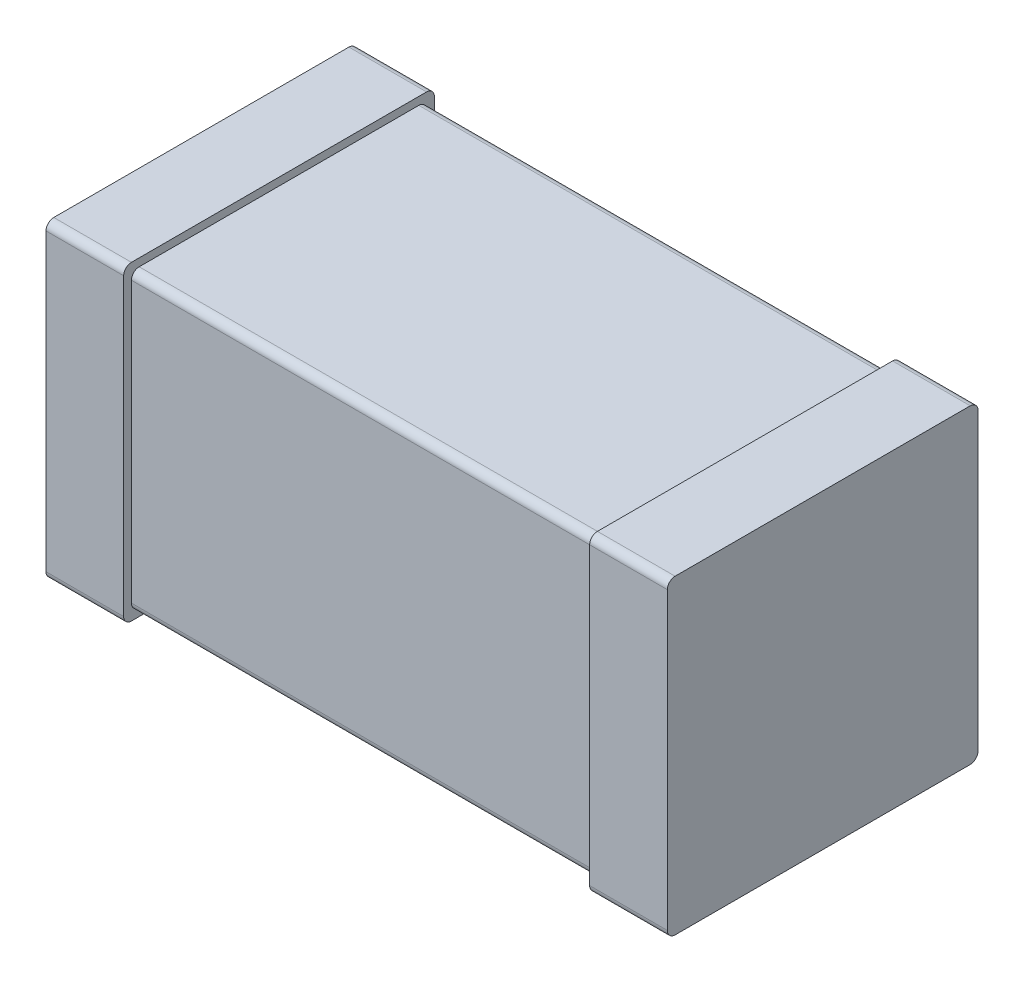
ISO-10303-21;
HEADER;
FILE_DESCRIPTION(('STEP AP214'),'2;1');
FILE_NAME('part.step','',(''),(''),'','','');
FILE_SCHEMA(('AUTOMOTIVE_DESIGN { 1 0 10303 214 1 1 1 1 }'));
ENDSEC;
DATA;
#1=APPLICATION_CONTEXT('core data for automotive mechanical design processes');
#2=APPLICATION_PROTOCOL_DEFINITION('international standard','automotive_design',2000,#1);
#3=PRODUCT_CONTEXT('',#1,'mechanical');
#4=PRODUCT('Part','Part','',(#3));
#5=PRODUCT_RELATED_PRODUCT_CATEGORY('part','',(#4));
#6=PRODUCT_DEFINITION_FORMATION('','',#4);
#7=PRODUCT_DEFINITION_CONTEXT('part definition',#1,'design');
#8=PRODUCT_DEFINITION('design','',#6,#7);
#9=PRODUCT_DEFINITION_SHAPE('','',#8);
#10=(LENGTH_UNIT() NAMED_UNIT(*) SI_UNIT(.MILLI.,.METRE.));
#11=(NAMED_UNIT(*) PLANE_ANGLE_UNIT() SI_UNIT($,.RADIAN.));
#12=(NAMED_UNIT(*) SI_UNIT($,.STERADIAN.) SOLID_ANGLE_UNIT());
#13=UNCERTAINTY_MEASURE_WITH_UNIT(LENGTH_MEASURE(1.E-05),#10,'distance_accuracy_value','');
#14=(GEOMETRIC_REPRESENTATION_CONTEXT(3) GLOBAL_UNCERTAINTY_ASSIGNED_CONTEXT((#13)) GLOBAL_UNIT_ASSIGNED_CONTEXT((#10,
#11,#12)) REPRESENTATION_CONTEXT('',''));
#15=CARTESIAN_POINT('',(0.,0.,0.));
#16=DIRECTION('',(0.,0.,1.));
#17=DIRECTION('',(1.,0.,0.));
#18=AXIS2_PLACEMENT_3D('',#15,#16,#17);
#19=CARTESIAN_POINT('',(-1.6,-0.8,0.));
#20=DIRECTION('',(1.,0.,0.));
#21=DIRECTION('',(0.,1.,0.));
#22=AXIS2_PLACEMENT_3D('',#19,#20,#21);
#23=PLANE('',#22);
#24=CARTESIAN_POINT('',(-1.6,-0.76,1.56));
#25=DIRECTION('',(-1.,0.,0.));
#26=DIRECTION('',(0.,0.,1.));
#27=AXIS2_PLACEMENT_3D('',#24,#25,#26);
#28=CIRCLE('',#27,0.04);
#29=CARTESIAN_POINT('',(-1.6,-0.8,1.56));
#30=VERTEX_POINT('',#29);
#31=CARTESIAN_POINT('',(-1.6,-0.76,1.6));
#32=VERTEX_POINT('',#31);
#33=EDGE_CURVE('E11',#30,#32,#28,.T.);
#34=ORIENTED_EDGE('',*,*,#33,.T.);
#35=DIRECTION('',(0.,1.,0.));
#36=VECTOR('',#35,1.);
#37=CARTESIAN_POINT('',(-1.6,-0.8,1.6));
#38=LINE('',#37,#36);
#39=CARTESIAN_POINT('',(-1.6,0.76,1.6));
#40=VERTEX_POINT('',#39);
#41=EDGE_CURVE('E27',#32,#40,#38,.T.);
#42=ORIENTED_EDGE('',*,*,#41,.T.);
#43=CARTESIAN_POINT('',(-1.6,0.76,1.56));
#44=DIRECTION('',(1.,0.,0.));
#45=DIRECTION('',(0.,0.,1.));
#46=AXIS2_PLACEMENT_3D('',#43,#44,#45);
#47=CIRCLE('',#46,0.04);
#48=CARTESIAN_POINT('',(-1.6,0.8,1.56));
#49=VERTEX_POINT('',#48);
#50=EDGE_CURVE('E336',#49,#40,#47,.T.);
#51=ORIENTED_EDGE('',*,*,#50,.F.);
#52=DIRECTION('',(0.,0.,1.));
#53=VECTOR('',#52,1.);
#54=CARTESIAN_POINT('',(-1.6,0.8,0.));
#55=LINE('',#54,#53);
#56=CARTESIAN_POINT('',(-1.6,0.8,0.04));
#57=VERTEX_POINT('',#56);
#58=EDGE_CURVE('E309',#57,#49,#55,.T.);
#59=ORIENTED_EDGE('',*,*,#58,.F.);
#60=CARTESIAN_POINT('',(-1.6,0.76,0.04));
#61=DIRECTION('',(-1.,0.,0.));
#62=DIRECTION('',(0.,0.,1.));
#63=AXIS2_PLACEMENT_3D('',#60,#61,#62);
#64=CIRCLE('',#63,0.04);
#65=CARTESIAN_POINT('',(-1.6,0.76,0.));
#66=VERTEX_POINT('',#65);
#67=EDGE_CURVE('E317',#57,#66,#64,.T.);
#68=ORIENTED_EDGE('',*,*,#67,.T.);
#69=DIRECTION('',(0.,1.,0.));
#70=VECTOR('',#69,1.);
#71=CARTESIAN_POINT('',(-1.6,-0.8,0.));
#72=LINE('',#71,#70);
#73=CARTESIAN_POINT('',(-1.6,-0.76,0.));
#74=VERTEX_POINT('',#73);
#75=EDGE_CURVE('E417',#74,#66,#72,.T.);
#76=ORIENTED_EDGE('',*,*,#75,.F.);
#77=CARTESIAN_POINT('',(-1.6,-0.76,0.04));
#78=DIRECTION('',(1.,0.,0.));
#79=DIRECTION('',(0.,0.,1.));
#80=AXIS2_PLACEMENT_3D('',#77,#78,#79);
#81=CIRCLE('',#80,0.04);
#82=CARTESIAN_POINT('',(-1.6,-0.8,0.04));
#83=VERTEX_POINT('',#82);
#84=EDGE_CURVE('E397',#83,#74,#81,.T.);
#85=ORIENTED_EDGE('',*,*,#84,.F.);
#86=DIRECTION('',(0.,0.,1.));
#87=VECTOR('',#86,1.);
#88=CARTESIAN_POINT('',(-1.6,-0.8,0.));
#89=LINE('',#88,#87);
#90=EDGE_CURVE('E364',#83,#30,#89,.T.);
#91=ORIENTED_EDGE('',*,*,#90,.T.);
#92=EDGE_LOOP('',(#34,#42,#51,#59,#68,#76,#85,#91));
#93=FACE_BOUND('',#92,.T.);
#94=ADVANCED_FACE('F16',(#93),#23,.F.);
#95=CARTESIAN_POINT('',(-1.6,-0.8,0.));
#96=DIRECTION('',(0.,1.,0.));
#97=DIRECTION('',(1.,0.,0.));
#98=AXIS2_PLACEMENT_3D('',#95,#96,#97);
#99=PLANE('',#98);
#100=DIRECTION('',(1.,0.,0.));
#101=VECTOR('',#100,1.);
#102=CARTESIAN_POINT('',(-1.6,-0.8,1.56));
#103=LINE('',#102,#101);
#104=CARTESIAN_POINT('',(-1.2,-0.8,1.56));
#105=VERTEX_POINT('',#104);
#106=EDGE_CURVE('E322',#30,#105,#103,.T.);
#107=ORIENTED_EDGE('',*,*,#106,.F.);
#108=ORIENTED_EDGE('',*,*,#90,.F.);
#109=DIRECTION('',(1.,0.,0.));
#110=VECTOR('',#109,1.);
#111=CARTESIAN_POINT('',(-1.6,-0.8,0.04));
#112=LINE('',#111,#110);
#113=CARTESIAN_POINT('',(-1.2,-0.8,0.04));
#114=VERTEX_POINT('',#113);
#115=EDGE_CURVE('E383',#83,#114,#112,.T.);
#116=ORIENTED_EDGE('',*,*,#115,.T.);
#117=DIRECTION('',(0.,0.,1.));
#118=VECTOR('',#117,1.);
#119=CARTESIAN_POINT('',(-1.2,-0.8,0.));
#120=LINE('',#119,#118);
#121=EDGE_CURVE('E386',#114,#105,#120,.T.);
#122=ORIENTED_EDGE('',*,*,#121,.T.);
#123=EDGE_LOOP('',(#107,#108,#116,#122));
#124=FACE_BOUND('',#123,.T.);
#125=ADVANCED_FACE('F614',(#124),#99,.F.);
#126=CARTESIAN_POINT('',(-1.6,-0.76,0.04));
#127=DIRECTION('',(1.,0.,0.));
#128=DIRECTION('',(0.,-1.,0.));
#129=AXIS2_PLACEMENT_3D('',#126,#127,#128);
#130=CYLINDRICAL_SURFACE('',#129,0.04);
#131=ORIENTED_EDGE('',*,*,#84,.T.);
#132=DIRECTION('',(1.,0.,0.));
#133=VECTOR('',#132,1.);
#134=CARTESIAN_POINT('',(-1.6,-0.76,0.));
#135=LINE('',#134,#133);
#136=CARTESIAN_POINT('',(-1.2,-0.76,0.));
#137=VERTEX_POINT('',#136);
#138=EDGE_CURVE('E324',#74,#137,#135,.T.);
#139=ORIENTED_EDGE('',*,*,#138,.T.);
#140=CARTESIAN_POINT('',(-1.2,-0.76,0.04));
#141=DIRECTION('',(1.,0.,0.));
#142=DIRECTION('',(0.,0.,1.));
#143=AXIS2_PLACEMENT_3D('',#140,#141,#142);
#144=CIRCLE('',#143,0.04);
#145=EDGE_CURVE('E310',#114,#137,#144,.T.);
#146=ORIENTED_EDGE('',*,*,#145,.F.);
#147=ORIENTED_EDGE('',*,*,#115,.F.);
#148=EDGE_LOOP('',(#131,#139,#146,#147));
#149=FACE_BOUND('',#148,.T.);
#150=ADVANCED_FACE('F618',(#149),#130,.T.);
#151=CARTESIAN_POINT('',(-1.6,-0.76,1.56));
#152=DIRECTION('',(1.,0.,0.));
#153=DIRECTION('',(0.,-1.,0.));
#154=AXIS2_PLACEMENT_3D('',#151,#152,#153);
#155=CYLINDRICAL_SURFACE('',#154,0.04);
#156=ORIENTED_EDGE('',*,*,#106,.T.);
#157=CARTESIAN_POINT('',(-1.2,-0.76,1.56));
#158=DIRECTION('',(-1.,0.,0.));
#159=DIRECTION('',(0.,0.,1.));
#160=AXIS2_PLACEMENT_3D('',#157,#158,#159);
#161=CIRCLE('',#160,0.04);
#162=CARTESIAN_POINT('',(-1.2,-0.76,1.6));
#163=VERTEX_POINT('',#162);
#164=EDGE_CURVE('E325',#105,#163,#161,.T.);
#165=ORIENTED_EDGE('',*,*,#164,.T.);
#166=DIRECTION('',(1.,0.,0.));
#167=VECTOR('',#166,1.);
#168=CARTESIAN_POINT('',(-1.6,-0.76,1.6));
#169=LINE('',#168,#167);
#170=EDGE_CURVE('E468',#32,#163,#169,.T.);
#171=ORIENTED_EDGE('',*,*,#170,.F.);
#172=ORIENTED_EDGE('',*,*,#33,.F.);
#173=EDGE_LOOP('',(#156,#165,#171,#172));
#174=FACE_BOUND('',#173,.T.);
#175=ADVANCED_FACE('F682',(#174),#155,.T.);
#176=CARTESIAN_POINT('',(-1.6,-0.8,0.));
#177=DIRECTION('',(0.,0.,1.));
#178=DIRECTION('',(1.,0.,0.));
#179=AXIS2_PLACEMENT_3D('',#176,#177,#178);
#180=PLANE('',#179);
#181=DIRECTION('',(1.,0.,0.));
#182=VECTOR('',#181,1.);
#183=CARTESIAN_POINT('',(-1.6,0.76,0.));
#184=LINE('',#183,#182);
#185=CARTESIAN_POINT('',(-1.2,0.76,0.));
#186=VERTEX_POINT('',#185);
#187=EDGE_CURVE('E413',#66,#186,#184,.T.);
#188=ORIENTED_EDGE('',*,*,#187,.T.);
#189=DIRECTION('',(0.,1.,0.));
#190=VECTOR('',#189,1.);
#191=CARTESIAN_POINT('',(-1.2,-0.8,0.));
#192=LINE('',#191,#190);
#193=EDGE_CURVE('E430',#137,#186,#192,.T.);
#194=ORIENTED_EDGE('',*,*,#193,.F.);
#195=ORIENTED_EDGE('',*,*,#138,.F.);
#196=ORIENTED_EDGE('',*,*,#75,.T.);
#197=EDGE_LOOP('',(#188,#194,#195,#196));
#198=FACE_BOUND('',#197,.T.);
#199=ADVANCED_FACE('F563',(#198),#180,.F.);
#200=CARTESIAN_POINT('',(-1.6,-0.8,1.6));
#201=DIRECTION('',(0.,0.,1.));
#202=DIRECTION('',(1.,0.,0.));
#203=AXIS2_PLACEMENT_3D('',#200,#201,#202);
#204=PLANE('',#203);
#205=ORIENTED_EDGE('',*,*,#41,.F.);
#206=ORIENTED_EDGE('',*,*,#170,.T.);
#207=DIRECTION('',(0.,1.,0.));
#208=VECTOR('',#207,1.);
#209=CARTESIAN_POINT('',(-1.2,-0.8,1.6));
#210=LINE('',#209,#208);
#211=CARTESIAN_POINT('',(-1.2,0.76,1.6));
#212=VERTEX_POINT('',#211);
#213=EDGE_CURVE('E471',#163,#212,#210,.T.);
#214=ORIENTED_EDGE('',*,*,#213,.T.);
#215=DIRECTION('',(1.,0.,0.));
#216=VECTOR('',#215,1.);
#217=CARTESIAN_POINT('',(-1.6,0.76,1.6));
#218=LINE('',#217,#216);
#219=EDGE_CURVE('E328',#40,#212,#218,.T.);
#220=ORIENTED_EDGE('',*,*,#219,.F.);
#221=EDGE_LOOP('',(#205,#206,#214,#220));
#222=FACE_BOUND('',#221,.T.);
#223=ADVANCED_FACE('F742',(#222),#204,.T.);
#224=CARTESIAN_POINT('',(-1.6,0.76,0.04));
#225=DIRECTION('',(1.,0.,0.));
#226=DIRECTION('',(0.,1.,0.));
#227=AXIS2_PLACEMENT_3D('',#224,#225,#226);
#228=CYLINDRICAL_SURFACE('',#227,0.04);
#229=DIRECTION('',(1.,0.,0.));
#230=VECTOR('',#229,1.);
#231=CARTESIAN_POINT('',(-1.6,0.8,0.04));
#232=LINE('',#231,#230);
#233=CARTESIAN_POINT('',(-1.2,0.8,0.04));
#234=VERTEX_POINT('',#233);
#235=EDGE_CURVE('E478',#57,#234,#232,.T.);
#236=ORIENTED_EDGE('',*,*,#235,.T.);
#237=CARTESIAN_POINT('',(-1.2,0.76,0.04));
#238=DIRECTION('',(-1.,0.,0.));
#239=DIRECTION('',(0.,0.,1.));
#240=AXIS2_PLACEMENT_3D('',#237,#238,#239);
#241=CIRCLE('',#240,0.04);
#242=EDGE_CURVE('E343',#234,#186,#241,.T.);
#243=ORIENTED_EDGE('',*,*,#242,.T.);
#244=ORIENTED_EDGE('',*,*,#187,.F.);
#245=ORIENTED_EDGE('',*,*,#67,.F.);
#246=EDGE_LOOP('',(#236,#243,#244,#245));
#247=FACE_BOUND('',#246,.T.);
#248=ADVANCED_FACE('F554',(#247),#228,.T.);
#249=CARTESIAN_POINT('',(-1.6,0.76,1.56));
#250=DIRECTION('',(1.,0.,0.));
#251=DIRECTION('',(0.,1.,0.));
#252=AXIS2_PLACEMENT_3D('',#249,#250,#251);
#253=CYLINDRICAL_SURFACE('',#252,0.04);
#254=ORIENTED_EDGE('',*,*,#50,.T.);
#255=ORIENTED_EDGE('',*,*,#219,.T.);
#256=CARTESIAN_POINT('',(-1.2,0.76,1.56));
#257=DIRECTION('',(1.,0.,0.));
#258=DIRECTION('',(0.,0.,1.));
#259=AXIS2_PLACEMENT_3D('',#256,#257,#258);
#260=CIRCLE('',#259,0.04);
#261=CARTESIAN_POINT('',(-1.2,0.8,1.56));
#262=VERTEX_POINT('',#261);
#263=EDGE_CURVE('E91',#262,#212,#260,.T.);
#264=ORIENTED_EDGE('',*,*,#263,.F.);
#265=DIRECTION('',(1.,0.,0.));
#266=VECTOR('',#265,1.);
#267=CARTESIAN_POINT('',(-1.6,0.8,1.56));
#268=LINE('',#267,#266);
#269=EDGE_CURVE('E306',#49,#262,#268,.T.);
#270=ORIENTED_EDGE('',*,*,#269,.F.);
#271=EDGE_LOOP('',(#254,#255,#264,#270));
#272=FACE_BOUND('',#271,.T.);
#273=ADVANCED_FACE('F673',(#272),#253,.T.);
#274=CARTESIAN_POINT('',(-1.6,0.8,0.));
#275=DIRECTION('',(0.,1.,0.));
#276=DIRECTION('',(1.,0.,0.));
#277=AXIS2_PLACEMENT_3D('',#274,#275,#276);
#278=PLANE('',#277);
#279=DIRECTION('',(0.,0.,1.));
#280=VECTOR('',#279,1.);
#281=CARTESIAN_POINT('',(-1.2,0.8,0.));
#282=LINE('',#281,#280);
#283=EDGE_CURVE('E420',#234,#262,#282,.T.);
#284=ORIENTED_EDGE('',*,*,#283,.F.);
#285=ORIENTED_EDGE('',*,*,#235,.F.);
#286=ORIENTED_EDGE('',*,*,#58,.T.);
#287=ORIENTED_EDGE('',*,*,#269,.T.);
#288=EDGE_LOOP('',(#284,#285,#286,#287));
#289=FACE_BOUND('',#288,.T.);
#290=ADVANCED_FACE('F556',(#289),#278,.T.);
#291=CARTESIAN_POINT('',(-1.2,-0.8,0.));
#292=DIRECTION('',(1.,0.,0.));
#293=DIRECTION('',(0.,1.,0.));
#294=AXIS2_PLACEMENT_3D('',#291,#292,#293);
#295=PLANE('',#294);
#296=ORIENTED_EDGE('',*,*,#121,.F.);
#297=ORIENTED_EDGE('',*,*,#145,.T.);
#298=ORIENTED_EDGE('',*,*,#193,.T.);
#299=ORIENTED_EDGE('',*,*,#242,.F.);
#300=ORIENTED_EDGE('',*,*,#283,.T.);
#301=ORIENTED_EDGE('',*,*,#263,.T.);
#302=ORIENTED_EDGE('',*,*,#213,.F.);
#303=ORIENTED_EDGE('',*,*,#164,.F.);
#304=EDGE_LOOP('',(#296,#297,#298,#299,#300,#301,#302,#303));
#305=FACE_BOUND('',#304,.T.);
#306=CARTESIAN_POINT('',(-1.2,-0.72,0.08));
#307=DIRECTION('',(1.,0.,0.));
#308=DIRECTION('',(0.,0.,1.));
#309=AXIS2_PLACEMENT_3D('',#306,#307,#308);
#310=CIRCLE('',#309,0.04);
#311=CARTESIAN_POINT('',(-1.2,-0.76,0.08));
#312=VERTEX_POINT('',#311);
#313=CARTESIAN_POINT('',(-1.2,-0.72,0.04));
#314=VERTEX_POINT('',#313);
#315=EDGE_CURVE('E108',#312,#314,#310,.T.);
#316=ORIENTED_EDGE('',*,*,#315,.F.);
#317=DIRECTION('',(0.,0.,1.));
#318=VECTOR('',#317,1.);
#319=CARTESIAN_POINT('',(-1.2,-0.76,0.04));
#320=LINE('',#319,#318);
#321=CARTESIAN_POINT('',(-1.2,-0.76,1.52));
#322=VERTEX_POINT('',#321);
#323=EDGE_CURVE('E421',#312,#322,#320,.T.);
#324=ORIENTED_EDGE('',*,*,#323,.T.);
#325=CARTESIAN_POINT('',(-1.2,-0.72,1.52));
#326=DIRECTION('',(-1.,0.,0.));
#327=DIRECTION('',(0.,0.,1.));
#328=AXIS2_PLACEMENT_3D('',#325,#326,#327);
#329=CIRCLE('',#328,0.04);
#330=CARTESIAN_POINT('',(-1.2,-0.72,1.56));
#331=VERTEX_POINT('',#330);
#332=EDGE_CURVE('E352',#322,#331,#329,.T.);
#333=ORIENTED_EDGE('',*,*,#332,.T.);
#334=DIRECTION('',(0.,1.,0.));
#335=VECTOR('',#334,1.);
#336=CARTESIAN_POINT('',(-1.2,-0.76,1.56));
#337=LINE('',#336,#335);
#338=CARTESIAN_POINT('',(-1.2,0.72,1.56));
#339=VERTEX_POINT('',#338);
#340=EDGE_CURVE('E348',#331,#339,#337,.T.);
#341=ORIENTED_EDGE('',*,*,#340,.T.);
#342=CARTESIAN_POINT('',(-1.2,0.72,1.52));
#343=DIRECTION('',(1.,0.,0.));
#344=DIRECTION('',(0.,0.,1.));
#345=AXIS2_PLACEMENT_3D('',#342,#343,#344);
#346=CIRCLE('',#345,0.04);
#347=CARTESIAN_POINT('',(-1.2,0.76,1.52));
#348=VERTEX_POINT('',#347);
#349=EDGE_CURVE('E354',#348,#339,#346,.T.);
#350=ORIENTED_EDGE('',*,*,#349,.F.);
#351=DIRECTION('',(0.,0.,1.));
#352=VECTOR('',#351,1.);
#353=CARTESIAN_POINT('',(-1.2,0.76,0.04));
#354=LINE('',#353,#352);
#355=CARTESIAN_POINT('',(-1.2,0.76,0.08));
#356=VERTEX_POINT('',#355);
#357=EDGE_CURVE('E475',#356,#348,#354,.T.);
#358=ORIENTED_EDGE('',*,*,#357,.F.);
#359=CARTESIAN_POINT('',(-1.2,0.72,0.08));
#360=DIRECTION('',(-1.,0.,0.));
#361=DIRECTION('',(0.,0.,1.));
#362=AXIS2_PLACEMENT_3D('',#359,#360,#361);
#363=CIRCLE('',#362,0.04);
#364=CARTESIAN_POINT('',(-1.2,0.72,0.04));
#365=VERTEX_POINT('',#364);
#366=EDGE_CURVE('E353',#356,#365,#363,.T.);
#367=ORIENTED_EDGE('',*,*,#366,.T.);
#368=DIRECTION('',(0.,1.,0.));
#369=VECTOR('',#368,1.);
#370=CARTESIAN_POINT('',(-1.2,-0.76,0.04));
#371=LINE('',#370,#369);
#372=EDGE_CURVE('E411',#314,#365,#371,.T.);
#373=ORIENTED_EDGE('',*,*,#372,.F.);
#374=EDGE_LOOP('',(#316,#324,#333,#341,#350,#358,#367,#373));
#375=FACE_BOUND('',#374,.T.);
#376=ADVANCED_FACE('F453',(#305,#375),#295,.T.);
#377=CARTESIAN_POINT('',(-1.2,-0.72,0.08));
#378=DIRECTION('',(1.,0.,0.));
#379=DIRECTION('',(0.,-1.,0.));
#380=AXIS2_PLACEMENT_3D('',#377,#378,#379);
#381=CYLINDRICAL_SURFACE('',#380,0.04);
#382=ORIENTED_EDGE('',*,*,#315,.T.);
#383=DIRECTION('',(1.,0.,0.));
#384=VECTOR('',#383,1.);
#385=CARTESIAN_POINT('',(-1.2,-0.72,0.04));
#386=LINE('',#385,#384);
#387=CARTESIAN_POINT('',(1.2,-0.72,0.04));
#388=VERTEX_POINT('',#387);
#389=EDGE_CURVE('E261',#314,#388,#386,.T.);
#390=ORIENTED_EDGE('',*,*,#389,.T.);
#391=CARTESIAN_POINT('',(1.2,-0.72,0.08));
#392=DIRECTION('',(1.,0.,0.));
#393=DIRECTION('',(0.,0.,1.));
#394=AXIS2_PLACEMENT_3D('',#391,#392,#393);
#395=CIRCLE('',#394,0.04);
#396=CARTESIAN_POINT('',(1.2,-0.76,0.08));
#397=VERTEX_POINT('',#396);
#398=EDGE_CURVE('E243',#397,#388,#395,.T.);
#399=ORIENTED_EDGE('',*,*,#398,.F.);
#400=DIRECTION('',(1.,0.,0.));
#401=VECTOR('',#400,1.);
#402=CARTESIAN_POINT('',(-1.2,-0.76,0.08));
#403=LINE('',#402,#401);
#404=EDGE_CURVE('E378',#312,#397,#403,.T.);
#405=ORIENTED_EDGE('',*,*,#404,.F.);
#406=EDGE_LOOP('',(#382,#390,#399,#405));
#407=FACE_BOUND('',#406,.T.);
#408=ADVANCED_FACE('F262',(#407),#381,.T.);
#409=CARTESIAN_POINT('',(-1.2,-0.76,0.04));
#410=DIRECTION('',(0.,0.,1.));
#411=DIRECTION('',(1.,0.,0.));
#412=AXIS2_PLACEMENT_3D('',#409,#410,#411);
#413=PLANE('',#412);
#414=DIRECTION('',(1.,0.,0.));
#415=VECTOR('',#414,1.);
#416=CARTESIAN_POINT('',(-1.2,0.72,0.04));
#417=LINE('',#416,#415);
#418=CARTESIAN_POINT('',(1.2,0.72,0.04));
#419=VERTEX_POINT('',#418);
#420=EDGE_CURVE('E265',#365,#419,#417,.T.);
#421=ORIENTED_EDGE('',*,*,#420,.T.);
#422=DIRECTION('',(0.,1.,0.));
#423=VECTOR('',#422,1.);
#424=CARTESIAN_POINT('',(1.2,-0.76,0.04));
#425=LINE('',#424,#423);
#426=EDGE_CURVE('E248',#388,#419,#425,.T.);
#427=ORIENTED_EDGE('',*,*,#426,.F.);
#428=ORIENTED_EDGE('',*,*,#389,.F.);
#429=ORIENTED_EDGE('',*,*,#372,.T.);
#430=EDGE_LOOP('',(#421,#427,#428,#429));
#431=FACE_BOUND('',#430,.T.);
#432=ADVANCED_FACE('F267',(#431),#413,.F.);
#433=CARTESIAN_POINT('',(-1.2,0.72,0.08));
#434=DIRECTION('',(1.,0.,0.));
#435=DIRECTION('',(0.,1.,0.));
#436=AXIS2_PLACEMENT_3D('',#433,#434,#435);
#437=CYLINDRICAL_SURFACE('',#436,0.04);
#438=DIRECTION('',(1.,0.,0.));
#439=VECTOR('',#438,1.);
#440=CARTESIAN_POINT('',(-1.2,0.76,0.08));
#441=LINE('',#440,#439);
#442=CARTESIAN_POINT('',(1.2,0.76,0.08));
#443=VERTEX_POINT('',#442);
#444=EDGE_CURVE('E20',#356,#443,#441,.T.);
#445=ORIENTED_EDGE('',*,*,#444,.T.);
#446=CARTESIAN_POINT('',(1.2,0.72,0.08));
#447=DIRECTION('',(-1.,0.,0.));
#448=DIRECTION('',(0.,0.,1.));
#449=AXIS2_PLACEMENT_3D('',#446,#447,#448);
#450=CIRCLE('',#449,0.04);
#451=EDGE_CURVE('E472',#443,#419,#450,.T.);
#452=ORIENTED_EDGE('',*,*,#451,.T.);
#453=ORIENTED_EDGE('',*,*,#420,.F.);
#454=ORIENTED_EDGE('',*,*,#366,.F.);
#455=EDGE_LOOP('',(#445,#452,#453,#454));
#456=FACE_BOUND('',#455,.T.);
#457=ADVANCED_FACE('F692',(#456),#437,.T.);
#458=CARTESIAN_POINT('',(-1.2,0.76,0.04));
#459=DIRECTION('',(0.,1.,0.));
#460=DIRECTION('',(1.,0.,0.));
#461=AXIS2_PLACEMENT_3D('',#458,#459,#460);
#462=PLANE('',#461);
#463=DIRECTION('',(0.,0.,1.));
#464=VECTOR('',#463,1.);
#465=CARTESIAN_POINT('',(1.2,0.76,0.04));
#466=LINE('',#465,#464);
#467=CARTESIAN_POINT('',(1.2,0.76,1.52));
#468=VERTEX_POINT('',#467);
#469=EDGE_CURVE('E272',#443,#468,#466,.T.);
#470=ORIENTED_EDGE('',*,*,#469,.F.);
#471=ORIENTED_EDGE('',*,*,#444,.F.);
#472=ORIENTED_EDGE('',*,*,#357,.T.);
#473=DIRECTION('',(1.,0.,0.));
#474=VECTOR('',#473,1.);
#475=CARTESIAN_POINT('',(-1.2,0.76,1.52));
#476=LINE('',#475,#474);
#477=EDGE_CURVE('E357',#348,#468,#476,.T.);
#478=ORIENTED_EDGE('',*,*,#477,.T.);
#479=EDGE_LOOP('',(#470,#471,#472,#478));
#480=FACE_BOUND('',#479,.T.);
#481=ADVANCED_FACE('F636',(#480),#462,.T.);
#482=CARTESIAN_POINT('',(-1.2,0.72,1.52));
#483=DIRECTION('',(1.,0.,0.));
#484=DIRECTION('',(0.,1.,0.));
#485=AXIS2_PLACEMENT_3D('',#482,#483,#484);
#486=CYLINDRICAL_SURFACE('',#485,0.04);
#487=ORIENTED_EDGE('',*,*,#349,.T.);
#488=DIRECTION('',(1.,0.,0.));
#489=VECTOR('',#488,1.);
#490=CARTESIAN_POINT('',(-1.2,0.72,1.56));
#491=LINE('',#490,#489);
#492=CARTESIAN_POINT('',(1.2,0.72,1.56));
#493=VERTEX_POINT('',#492);
#494=EDGE_CURVE('E358',#339,#493,#491,.T.);
#495=ORIENTED_EDGE('',*,*,#494,.T.);
#496=CARTESIAN_POINT('',(1.2,0.72,1.52));
#497=DIRECTION('',(1.,0.,0.));
#498=DIRECTION('',(0.,0.,1.));
#499=AXIS2_PLACEMENT_3D('',#496,#497,#498);
#500=CIRCLE('',#499,0.04);
#501=EDGE_CURVE('E257',#468,#493,#500,.T.);
#502=ORIENTED_EDGE('',*,*,#501,.F.);
#503=ORIENTED_EDGE('',*,*,#477,.F.);
#504=EDGE_LOOP('',(#487,#495,#502,#503));
#505=FACE_BOUND('',#504,.T.);
#506=ADVANCED_FACE('F632',(#505),#486,.T.);
#507=CARTESIAN_POINT('',(-1.2,-0.76,1.56));
#508=DIRECTION('',(0.,0.,1.));
#509=DIRECTION('',(1.,0.,0.));
#510=AXIS2_PLACEMENT_3D('',#507,#508,#509);
#511=PLANE('',#510);
#512=ORIENTED_EDGE('',*,*,#340,.F.);
#513=DIRECTION('',(1.,0.,0.));
#514=VECTOR('',#513,1.);
#515=CARTESIAN_POINT('',(-1.2,-0.72,1.56));
#516=LINE('',#515,#514);
#517=CARTESIAN_POINT('',(1.2,-0.72,1.56));
#518=VERTEX_POINT('',#517);
#519=EDGE_CURVE('E284',#331,#518,#516,.T.);
#520=ORIENTED_EDGE('',*,*,#519,.T.);
#521=DIRECTION('',(0.,1.,0.));
#522=VECTOR('',#521,1.);
#523=CARTESIAN_POINT('',(1.2,-0.76,1.56));
#524=LINE('',#523,#522);
#525=EDGE_CURVE('E376',#518,#493,#524,.T.);
#526=ORIENTED_EDGE('',*,*,#525,.T.);
#527=ORIENTED_EDGE('',*,*,#494,.F.);
#528=EDGE_LOOP('',(#512,#520,#526,#527));
#529=FACE_BOUND('',#528,.T.);
#530=ADVANCED_FACE('F451',(#529),#511,.T.);
#531=CARTESIAN_POINT('',(-1.2,-0.72,1.52));
#532=DIRECTION('',(1.,0.,0.));
#533=DIRECTION('',(0.,-1.,0.));
#534=AXIS2_PLACEMENT_3D('',#531,#532,#533);
#535=CYLINDRICAL_SURFACE('',#534,0.04);
#536=DIRECTION('',(1.,0.,0.));
#537=VECTOR('',#536,1.);
#538=CARTESIAN_POINT('',(-1.2,-0.76,1.52));
#539=LINE('',#538,#537);
#540=CARTESIAN_POINT('',(1.2,-0.76,1.52));
#541=VERTEX_POINT('',#540);
#542=EDGE_CURVE('E372',#322,#541,#539,.T.);
#543=ORIENTED_EDGE('',*,*,#542,.T.);
#544=CARTESIAN_POINT('',(1.2,-0.72,1.52));
#545=DIRECTION('',(-1.,0.,0.));
#546=DIRECTION('',(0.,0.,1.));
#547=AXIS2_PLACEMENT_3D('',#544,#545,#546);
#548=CIRCLE('',#547,0.04);
#549=EDGE_CURVE('E377',#541,#518,#548,.T.);
#550=ORIENTED_EDGE('',*,*,#549,.T.);
#551=ORIENTED_EDGE('',*,*,#519,.F.);
#552=ORIENTED_EDGE('',*,*,#332,.F.);
#553=EDGE_LOOP('',(#543,#550,#551,#552));
#554=FACE_BOUND('',#553,.T.);
#555=ADVANCED_FACE('F442',(#554),#535,.T.);
#556=CARTESIAN_POINT('',(-1.2,-0.76,0.04));
#557=DIRECTION('',(0.,1.,0.));
#558=DIRECTION('',(1.,0.,0.));
#559=AXIS2_PLACEMENT_3D('',#556,#557,#558);
#560=PLANE('',#559);
#561=ORIENTED_EDGE('',*,*,#542,.F.);
#562=ORIENTED_EDGE('',*,*,#323,.F.);
#563=ORIENTED_EDGE('',*,*,#404,.T.);
#564=DIRECTION('',(0.,0.,1.));
#565=VECTOR('',#564,1.);
#566=CARTESIAN_POINT('',(1.2,-0.76,0.04));
#567=LINE('',#566,#565);
#568=EDGE_CURVE('E252',#397,#541,#567,.T.);
#569=ORIENTED_EDGE('',*,*,#568,.T.);
#570=EDGE_LOOP('',(#561,#562,#563,#569));
#571=FACE_BOUND('',#570,.T.);
#572=ADVANCED_FACE('F18',(#571),#560,.F.);
#573=CARTESIAN_POINT('',(1.2,-0.8,0.));
#574=DIRECTION('',(1.,0.,0.));
#575=DIRECTION('',(0.,1.,0.));
#576=AXIS2_PLACEMENT_3D('',#573,#574,#575);
#577=PLANE('',#576);
#578=CARTESIAN_POINT('',(1.2,-0.76,1.56));
#579=DIRECTION('',(-1.,0.,0.));
#580=DIRECTION('',(0.,0.,1.));
#581=AXIS2_PLACEMENT_3D('',#578,#579,#580);
#582=CIRCLE('',#581,0.04);
#583=CARTESIAN_POINT('',(1.2,-0.8,1.56));
#584=VERTEX_POINT('',#583);
#585=CARTESIAN_POINT('',(1.2,-0.76,1.6));
#586=VERTEX_POINT('',#585);
#587=EDGE_CURVE('E301',#584,#586,#582,.T.);
#588=ORIENTED_EDGE('',*,*,#587,.T.);
#589=DIRECTION('',(0.,1.,0.));
#590=VECTOR('',#589,1.);
#591=CARTESIAN_POINT('',(1.2,-0.8,1.6));
#592=LINE('',#591,#590);
#593=CARTESIAN_POINT('',(1.2,0.76,1.6));
#594=VERTEX_POINT('',#593);
#595=EDGE_CURVE('E305',#586,#594,#592,.T.);
#596=ORIENTED_EDGE('',*,*,#595,.T.);
#597=CARTESIAN_POINT('',(1.2,0.76,1.56));
#598=DIRECTION('',(1.,0.,0.));
#599=DIRECTION('',(0.,0.,1.));
#600=AXIS2_PLACEMENT_3D('',#597,#598,#599);
#601=CIRCLE('',#600,0.04);
#602=CARTESIAN_POINT('',(1.2,0.8,1.56));
#603=VERTEX_POINT('',#602);
#604=EDGE_CURVE('E424',#603,#594,#601,.T.);
#605=ORIENTED_EDGE('',*,*,#604,.F.);
#606=DIRECTION('',(0.,0.,1.));
#607=VECTOR('',#606,1.);
#608=CARTESIAN_POINT('',(1.2,0.8,0.));
#609=LINE('',#608,#607);
#610=CARTESIAN_POINT('',(1.2,0.8,0.04));
#611=VERTEX_POINT('',#610);
#612=EDGE_CURVE('E178',#611,#603,#609,.T.);
#613=ORIENTED_EDGE('',*,*,#612,.F.);
#614=CARTESIAN_POINT('',(1.2,0.76,0.04));
#615=DIRECTION('',(-1.,0.,0.));
#616=DIRECTION('',(0.,0.,1.));
#617=AXIS2_PLACEMENT_3D('',#614,#615,#616);
#618=CIRCLE('',#617,0.04);
#619=CARTESIAN_POINT('',(1.2,0.76,0.));
#620=VERTEX_POINT('',#619);
#621=EDGE_CURVE('E278',#611,#620,#618,.T.);
#622=ORIENTED_EDGE('',*,*,#621,.T.);
#623=DIRECTION('',(0.,1.,0.));
#624=VECTOR('',#623,1.);
#625=CARTESIAN_POINT('',(1.2,-0.8,0.));
#626=LINE('',#625,#624);
#627=CARTESIAN_POINT('',(1.2,-0.76,0.));
#628=VERTEX_POINT('',#627);
#629=EDGE_CURVE('E365',#628,#620,#626,.T.);
#630=ORIENTED_EDGE('',*,*,#629,.F.);
#631=CARTESIAN_POINT('',(1.2,-0.76,0.04));
#632=DIRECTION('',(1.,0.,0.));
#633=DIRECTION('',(0.,0.,1.));
#634=AXIS2_PLACEMENT_3D('',#631,#632,#633);
#635=CIRCLE('',#634,0.04);
#636=CARTESIAN_POINT('',(1.2,-0.8,0.04));
#637=VERTEX_POINT('',#636);
#638=EDGE_CURVE('E463',#637,#628,#635,.T.);
#639=ORIENTED_EDGE('',*,*,#638,.F.);
#640=DIRECTION('',(0.,0.,1.));
#641=VECTOR('',#640,1.);
#642=CARTESIAN_POINT('',(1.2,-0.8,0.));
#643=LINE('',#642,#641);
#644=EDGE_CURVE('E271',#637,#584,#643,.T.);
#645=ORIENTED_EDGE('',*,*,#644,.T.);
#646=EDGE_LOOP('',(#588,#596,#605,#613,#622,#630,#639,#645));
#647=FACE_BOUND('',#646,.T.);
#648=ORIENTED_EDGE('',*,*,#426,.T.);
#649=ORIENTED_EDGE('',*,*,#451,.F.);
#650=ORIENTED_EDGE('',*,*,#469,.T.);
#651=ORIENTED_EDGE('',*,*,#501,.T.);
#652=ORIENTED_EDGE('',*,*,#525,.F.);
#653=ORIENTED_EDGE('',*,*,#549,.F.);
#654=ORIENTED_EDGE('',*,*,#568,.F.);
#655=ORIENTED_EDGE('',*,*,#398,.T.);
#656=EDGE_LOOP('',(#648,#649,#650,#651,#652,#653,#654,#655));
#657=FACE_BOUND('',#656,.T.);
#658=ADVANCED_FACE('F245',(#647,#657),#577,.F.);
#659=CARTESIAN_POINT('',(1.2,-0.8,0.));
#660=DIRECTION('',(0.,1.,0.));
#661=DIRECTION('',(1.,0.,0.));
#662=AXIS2_PLACEMENT_3D('',#659,#660,#661);
#663=PLANE('',#662);
#664=DIRECTION('',(1.,0.,0.));
#665=VECTOR('',#664,1.);
#666=CARTESIAN_POINT('',(1.2,-0.8,1.56));
#667=LINE('',#666,#665);
#668=CARTESIAN_POINT('',(1.6,-0.8,1.56));
#669=VERTEX_POINT('',#668);
#670=EDGE_CURVE('E286',#584,#669,#667,.T.);
#671=ORIENTED_EDGE('',*,*,#670,.F.);
#672=ORIENTED_EDGE('',*,*,#644,.F.);
#673=DIRECTION('',(1.,0.,0.));
#674=VECTOR('',#673,1.);
#675=CARTESIAN_POINT('',(1.2,-0.8,0.04));
#676=LINE('',#675,#674);
#677=CARTESIAN_POINT('',(1.6,-0.8,0.04));
#678=VERTEX_POINT('',#677);
#679=EDGE_CURVE('E258',#637,#678,#676,.T.);
#680=ORIENTED_EDGE('',*,*,#679,.T.);
#681=DIRECTION('',(0.,0.,1.));
#682=VECTOR('',#681,1.);
#683=CARTESIAN_POINT('',(1.6,-0.8,0.));
#684=LINE('',#683,#682);
#685=EDGE_CURVE('E409',#678,#669,#684,.T.);
#686=ORIENTED_EDGE('',*,*,#685,.T.);
#687=EDGE_LOOP('',(#671,#672,#680,#686));
#688=FACE_BOUND('',#687,.T.);
#689=ADVANCED_FACE('F593',(#688),#663,.F.);
#690=CARTESIAN_POINT('',(1.2,-0.76,0.04));
#691=DIRECTION('',(1.,0.,0.));
#692=DIRECTION('',(0.,-1.,0.));
#693=AXIS2_PLACEMENT_3D('',#690,#691,#692);
#694=CYLINDRICAL_SURFACE('',#693,0.04);
#695=ORIENTED_EDGE('',*,*,#638,.T.);
#696=DIRECTION('',(1.,0.,0.));
#697=VECTOR('',#696,1.);
#698=CARTESIAN_POINT('',(1.2,-0.76,0.));
#699=LINE('',#698,#697);
#700=CARTESIAN_POINT('',(1.6,-0.76,0.));
#701=VERTEX_POINT('',#700);
#702=EDGE_CURVE('E288',#628,#701,#699,.T.);
#703=ORIENTED_EDGE('',*,*,#702,.T.);
#704=CARTESIAN_POINT('',(1.6,-0.76,0.04));
#705=DIRECTION('',(1.,0.,0.));
#706=DIRECTION('',(0.,0.,1.));
#707=AXIS2_PLACEMENT_3D('',#704,#705,#706);
#708=CIRCLE('',#707,0.04);
#709=EDGE_CURVE('E313',#678,#701,#708,.T.);
#710=ORIENTED_EDGE('',*,*,#709,.F.);
#711=ORIENTED_EDGE('',*,*,#679,.F.);
#712=EDGE_LOOP('',(#695,#703,#710,#711));
#713=FACE_BOUND('',#712,.T.);
#714=ADVANCED_FACE('F597',(#713),#694,.T.);
#715=CARTESIAN_POINT('',(1.2,-0.76,1.56));
#716=DIRECTION('',(1.,0.,0.));
#717=DIRECTION('',(0.,-1.,0.));
#718=AXIS2_PLACEMENT_3D('',#715,#716,#717);
#719=CYLINDRICAL_SURFACE('',#718,0.04);
#720=ORIENTED_EDGE('',*,*,#670,.T.);
#721=CARTESIAN_POINT('',(1.6,-0.76,1.56));
#722=DIRECTION('',(-1.,0.,0.));
#723=DIRECTION('',(0.,0.,1.));
#724=AXIS2_PLACEMENT_3D('',#721,#722,#723);
#725=CIRCLE('',#724,0.04);
#726=CARTESIAN_POINT('',(1.6,-0.76,1.6));
#727=VERTEX_POINT('',#726);
#728=EDGE_CURVE('E289',#669,#727,#725,.T.);
#729=ORIENTED_EDGE('',*,*,#728,.T.);
#730=DIRECTION('',(1.,0.,0.));
#731=VECTOR('',#730,1.);
#732=CARTESIAN_POINT('',(1.2,-0.76,1.6));
#733=LINE('',#732,#731);
#734=EDGE_CURVE('E368',#586,#727,#733,.T.);
#735=ORIENTED_EDGE('',*,*,#734,.F.);
#736=ORIENTED_EDGE('',*,*,#587,.F.);
#737=EDGE_LOOP('',(#720,#729,#735,#736));
#738=FACE_BOUND('',#737,.T.);
#739=ADVANCED_FACE('F603',(#738),#719,.T.);
#740=CARTESIAN_POINT('',(1.2,-0.8,0.));
#741=DIRECTION('',(0.,0.,1.));
#742=DIRECTION('',(1.,0.,0.));
#743=AXIS2_PLACEMENT_3D('',#740,#741,#742);
#744=PLANE('',#743);
#745=DIRECTION('',(1.,0.,0.));
#746=VECTOR('',#745,1.);
#747=CARTESIAN_POINT('',(1.2,0.76,0.));
#748=LINE('',#747,#746);
#749=CARTESIAN_POINT('',(1.6,0.76,0.));
#750=VERTEX_POINT('',#749);
#751=EDGE_CURVE('E321',#620,#750,#748,.T.);
#752=ORIENTED_EDGE('',*,*,#751,.T.);
#753=DIRECTION('',(0.,1.,0.));
#754=VECTOR('',#753,1.);
#755=CARTESIAN_POINT('',(1.6,-0.8,0.));
#756=LINE('',#755,#754);
#757=EDGE_CURVE('E203',#701,#750,#756,.T.);
#758=ORIENTED_EDGE('',*,*,#757,.F.);
#759=ORIENTED_EDGE('',*,*,#702,.F.);
#760=ORIENTED_EDGE('',*,*,#629,.T.);
#761=EDGE_LOOP('',(#752,#758,#759,#760));
#762=FACE_BOUND('',#761,.T.);
#763=ADVANCED_FACE('F607',(#762),#744,.F.);
#764=CARTESIAN_POINT('',(1.2,-0.8,1.6));
#765=DIRECTION('',(0.,0.,1.));
#766=DIRECTION('',(1.,0.,0.));
#767=AXIS2_PLACEMENT_3D('',#764,#765,#766);
#768=PLANE('',#767);
#769=ORIENTED_EDGE('',*,*,#595,.F.);
#770=ORIENTED_EDGE('',*,*,#734,.T.);
#771=DIRECTION('',(0.,1.,0.));
#772=VECTOR('',#771,1.);
#773=CARTESIAN_POINT('',(1.6,-0.8,1.6));
#774=LINE('',#773,#772);
#775=CARTESIAN_POINT('',(1.6,0.76,1.6));
#776=VERTEX_POINT('',#775);
#777=EDGE_CURVE('E294',#727,#776,#774,.T.);
#778=ORIENTED_EDGE('',*,*,#777,.T.);
#779=DIRECTION('',(1.,0.,0.));
#780=VECTOR('',#779,1.);
#781=CARTESIAN_POINT('',(1.2,0.76,1.6));
#782=LINE('',#781,#780);
#783=EDGE_CURVE('E214',#594,#776,#782,.T.);
#784=ORIENTED_EDGE('',*,*,#783,.F.);
#785=EDGE_LOOP('',(#769,#770,#778,#784));
#786=FACE_BOUND('',#785,.T.);
#787=ADVANCED_FACE('F657',(#786),#768,.T.);
#788=CARTESIAN_POINT('',(1.2,0.76,0.04));
#789=DIRECTION('',(1.,0.,0.));
#790=DIRECTION('',(0.,1.,0.));
#791=AXIS2_PLACEMENT_3D('',#788,#789,#790);
#792=CYLINDRICAL_SURFACE('',#791,0.04);
#793=DIRECTION('',(1.,0.,0.));
#794=VECTOR('',#793,1.);
#795=CARTESIAN_POINT('',(1.2,0.8,0.04));
#796=LINE('',#795,#794);
#797=CARTESIAN_POINT('',(1.6,0.8,0.04));
#798=VERTEX_POINT('',#797);
#799=EDGE_CURVE('E290',#611,#798,#796,.T.);
#800=ORIENTED_EDGE('',*,*,#799,.T.);
#801=CARTESIAN_POINT('',(1.6,0.76,0.04));
#802=DIRECTION('',(-1.,0.,0.));
#803=DIRECTION('',(0.,0.,1.));
#804=AXIS2_PLACEMENT_3D('',#801,#802,#803);
#805=CIRCLE('',#804,0.04);
#806=EDGE_CURVE('E295',#798,#750,#805,.T.);
#807=ORIENTED_EDGE('',*,*,#806,.T.);
#808=ORIENTED_EDGE('',*,*,#751,.F.);
#809=ORIENTED_EDGE('',*,*,#621,.F.);
#810=EDGE_LOOP('',(#800,#807,#808,#809));
#811=FACE_BOUND('',#810,.T.);
#812=ADVANCED_FACE('F652',(#811),#792,.T.);
#813=CARTESIAN_POINT('',(1.2,0.76,1.56));
#814=DIRECTION('',(1.,0.,0.));
#815=DIRECTION('',(0.,1.,0.));
#816=AXIS2_PLACEMENT_3D('',#813,#814,#815);
#817=CYLINDRICAL_SURFACE('',#816,0.04);
#818=ORIENTED_EDGE('',*,*,#604,.T.);
#819=ORIENTED_EDGE('',*,*,#783,.T.);
#820=CARTESIAN_POINT('',(1.6,0.76,1.56));
#821=DIRECTION('',(1.,0.,0.));
#822=DIRECTION('',(0.,0.,1.));
#823=AXIS2_PLACEMENT_3D('',#820,#821,#822);
#824=CIRCLE('',#823,0.04);
#825=CARTESIAN_POINT('',(1.6,0.8,1.56));
#826=VERTEX_POINT('',#825);
#827=EDGE_CURVE('E296',#826,#776,#824,.T.);
#828=ORIENTED_EDGE('',*,*,#827,.F.);
#829=DIRECTION('',(1.,0.,0.));
#830=VECTOR('',#829,1.);
#831=CARTESIAN_POINT('',(1.2,0.8,1.56));
#832=LINE('',#831,#830);
#833=EDGE_CURVE('E311',#603,#826,#832,.T.);
#834=ORIENTED_EDGE('',*,*,#833,.F.);
#835=EDGE_LOOP('',(#818,#819,#828,#834));
#836=FACE_BOUND('',#835,.T.);
#837=ADVANCED_FACE('F656',(#836),#817,.T.);
#838=CARTESIAN_POINT('',(1.2,0.8,0.));
#839=DIRECTION('',(0.,1.,0.));
#840=DIRECTION('',(1.,0.,0.));
#841=AXIS2_PLACEMENT_3D('',#838,#839,#840);
#842=PLANE('',#841);
#843=DIRECTION('',(0.,0.,1.));
#844=VECTOR('',#843,1.);
#845=CARTESIAN_POINT('',(1.6,0.8,0.));
#846=LINE('',#845,#844);
#847=EDGE_CURVE('E300',#798,#826,#846,.T.);
#848=ORIENTED_EDGE('',*,*,#847,.F.);
#849=ORIENTED_EDGE('',*,*,#799,.F.);
#850=ORIENTED_EDGE('',*,*,#612,.T.);
#851=ORIENTED_EDGE('',*,*,#833,.T.);
#852=EDGE_LOOP('',(#848,#849,#850,#851));
#853=FACE_BOUND('',#852,.T.);
#854=ADVANCED_FACE('F733',(#853),#842,.T.);
#855=CARTESIAN_POINT('',(1.6,-0.8,0.));
#856=DIRECTION('',(1.,0.,0.));
#857=DIRECTION('',(0.,1.,0.));
#858=AXIS2_PLACEMENT_3D('',#855,#856,#857);
#859=PLANE('',#858);
#860=ORIENTED_EDGE('',*,*,#685,.F.);
#861=ORIENTED_EDGE('',*,*,#709,.T.);
#862=ORIENTED_EDGE('',*,*,#757,.T.);
#863=ORIENTED_EDGE('',*,*,#806,.F.);
#864=ORIENTED_EDGE('',*,*,#847,.T.);
#865=ORIENTED_EDGE('',*,*,#827,.T.);
#866=ORIENTED_EDGE('',*,*,#777,.F.);
#867=ORIENTED_EDGE('',*,*,#728,.F.);
#868=EDGE_LOOP('',(#860,#861,#862,#863,#864,#865,#866,#867));
#869=FACE_BOUND('',#868,.T.);
#870=ADVANCED_FACE('F729',(#869),#859,.T.);
#871=CLOSED_SHELL('',(#94,#125,#150,#175,#199,#223,#248,#273,#290,#376,#408,#432,#457,#481,#506,
#530,#555,#572,#658,#689,#714,#739,#763,#787,#812,#837,#854,#870));
#872=MANIFOLD_SOLID_BREP('B1',#871);
#873=ADVANCED_BREP_SHAPE_REPRESENTATION('',(#18,#872),#14);
#874=SHAPE_DEFINITION_REPRESENTATION(#9,#873);
ENDSEC;
END-ISO-10303-21;
